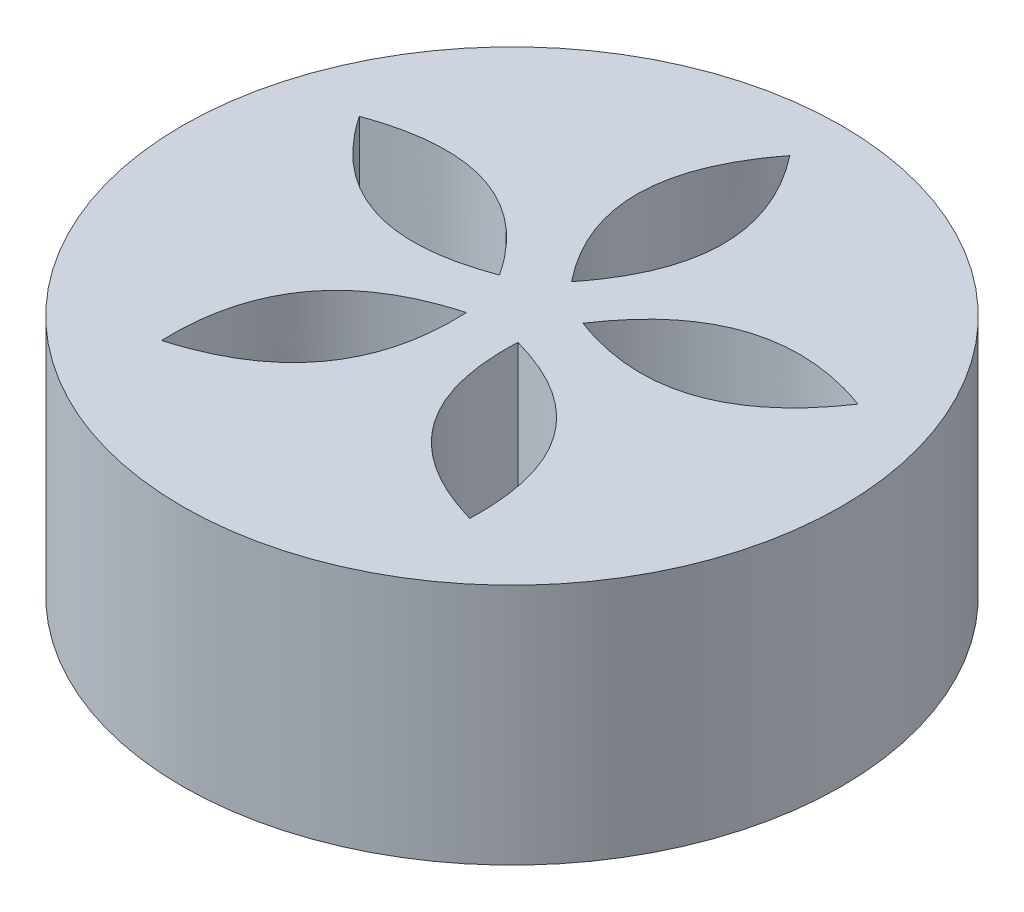
ISO-10303-21;
HEADER;
FILE_DESCRIPTION(('STEP AP214'),'2;1');
FILE_NAME('part.step','',(''),(''),'','','');
FILE_SCHEMA(('AUTOMOTIVE_DESIGN { 1 0 10303 214 1 1 1 1 }'));
ENDSEC;
DATA;
#1=APPLICATION_CONTEXT('core data for automotive mechanical design processes');
#2=APPLICATION_PROTOCOL_DEFINITION('international standard','automotive_design',2000,#1);
#3=PRODUCT_CONTEXT('',#1,'mechanical');
#4=PRODUCT('Part','Part','',(#3));
#5=PRODUCT_RELATED_PRODUCT_CATEGORY('part','',(#4));
#6=PRODUCT_DEFINITION_FORMATION('','',#4);
#7=PRODUCT_DEFINITION_CONTEXT('part definition',#1,'design');
#8=PRODUCT_DEFINITION('design','',#6,#7);
#9=PRODUCT_DEFINITION_SHAPE('','',#8);
#10=(LENGTH_UNIT() NAMED_UNIT(*) SI_UNIT(.MILLI.,.METRE.));
#11=(NAMED_UNIT(*) PLANE_ANGLE_UNIT() SI_UNIT($,.RADIAN.));
#12=(NAMED_UNIT(*) SI_UNIT($,.STERADIAN.) SOLID_ANGLE_UNIT());
#13=UNCERTAINTY_MEASURE_WITH_UNIT(LENGTH_MEASURE(1.E-05),#10,'distance_accuracy_value','');
#14=(GEOMETRIC_REPRESENTATION_CONTEXT(3) GLOBAL_UNCERTAINTY_ASSIGNED_CONTEXT((#13)) GLOBAL_UNIT_ASSIGNED_CONTEXT((#10,
#11,#12)) REPRESENTATION_CONTEXT('',''));
#15=CARTESIAN_POINT('',(0.,0.,0.));
#16=DIRECTION('',(0.,0.,1.));
#17=DIRECTION('',(1.,0.,0.));
#18=AXIS2_PLACEMENT_3D('',#15,#16,#17);
#19=CARTESIAN_POINT('',(0.,25.,0.));
#20=DIRECTION('',(0.,-1.,0.));
#21=DIRECTION('',(0.,0.,-1.));
#22=AXIS2_PLACEMENT_3D('',#19,#20,#21);
#23=CYLINDRICAL_SURFACE('',#22,34.);
#24=CARTESIAN_POINT('',(0.,25.,0.));
#25=DIRECTION('',(0.,1.,0.));
#26=DIRECTION('',(0.,0.,1.));
#27=AXIS2_PLACEMENT_3D('',#24,#25,#26);
#28=CIRCLE('',#27,34.);
#29=CARTESIAN_POINT('',(0.,25.,34.));
#30=VERTEX_POINT('',#29);
#31=EDGE_CURVE('E11',#30,#30,#28,.T.);
#32=ORIENTED_EDGE('',*,*,#31,.F.);
#33=EDGE_LOOP('',(#32));
#34=FACE_BOUND('',#33,.T.);
#35=CARTESIAN_POINT('',(0.,0.,0.));
#36=DIRECTION('',(0.,1.,0.));
#37=DIRECTION('',(0.,0.,1.));
#38=AXIS2_PLACEMENT_3D('',#35,#36,#37);
#39=CIRCLE('',#38,34.);
#40=CARTESIAN_POINT('',(0.,0.,34.));
#41=VERTEX_POINT('',#40);
#42=EDGE_CURVE('E39',#41,#41,#39,.T.);
#43=ORIENTED_EDGE('',*,*,#42,.T.);
#44=EDGE_LOOP('',(#43));
#45=FACE_BOUND('',#44,.T.);
#46=ADVANCED_FACE('F36',(#34,#45),#23,.T.);
#47=CARTESIAN_POINT('',(0.,25.,0.));
#48=DIRECTION('',(0.,1.,0.));
#49=DIRECTION('',(0.,0.,1.));
#50=AXIS2_PLACEMENT_3D('',#47,#48,#49);
#51=PLANE('',#50);
#52=CARTESIAN_POINT('',(25.7136760029647,25.,-9.97188350630448));
#53=CARTESIAN_POINT('',(17.6182519742214,25.,2.00829928825376));
#54=CARTESIAN_POINT('',(4.30416455451852,25.,-3.01551154998013));
#55=B_SPLINE_CURVE_WITH_KNOTS('',2,(#52,#53,#54),.UNSPECIFIED.,.F.,.F.,(3,3),(0.,1.),.UNSPECIFIED.);
#56=CARTESIAN_POINT('',(25.7136760029647,25.,-9.97188350630448));
#57=VERTEX_POINT('',#56);
#58=CARTESIAN_POINT('',(4.30416455451852,25.,-3.01551154998013));
#59=VERTEX_POINT('',#58);
#60=EDGE_CURVE('E50',#57,#59,#55,.T.);
#61=ORIENTED_EDGE('',*,*,#60,.T.);
#62=CARTESIAN_POINT('',(4.30416455451852,25.,-3.01551154998013));
#63=CARTESIAN_POINT('',(12.1225656206306,25.,-14.9056841276707));
#64=CARTESIAN_POINT('',(25.7136760029647,25.,-9.97188350630448));
#65=B_SPLINE_CURVE_WITH_KNOTS('',2,(#62,#63,#64),.UNSPECIFIED.,.F.,.F.,(3,3),(0.,1.),.UNSPECIFIED.);
#66=EDGE_CURVE('E217',#59,#57,#65,.T.);
#67=ORIENTED_EDGE('',*,*,#66,.T.);
#68=EDGE_LOOP('',(#61,#67));
#69=FACE_BOUND('',#68,.T.);
#70=CARTESIAN_POINT('',(15.891925745535,25.,20.2563555672349));
#71=CARTESIAN_POINT('',(1.99647123081033,25.,16.259229871763));
#72=CARTESIAN_POINT('',(2.66011998786504,25.,2.04433734719188));
#73=B_SPLINE_CURVE_WITH_KNOTS('',2,(#70,#71,#72),.UNSPECIFIED.,.F.,.F.,(3,3),(0.,1.),.UNSPECIFIED.);
#74=CARTESIAN_POINT('',(15.891925745535,25.,20.2563555672349));
#75=VERTEX_POINT('',#74);
#76=CARTESIAN_POINT('',(2.66011998786504,25.,2.04433734719188));
#77=VERTEX_POINT('',#76);
#78=EDGE_CURVE('E58',#75,#77,#73,.T.);
#79=ORIENTED_EDGE('',*,*,#78,.T.);
#80=CARTESIAN_POINT('',(2.66011998786504,25.,2.04433734719188));
#81=CARTESIAN_POINT('',(16.3843648960194,25.,5.80581323556946));
#82=CARTESIAN_POINT('',(15.891925745535,25.,20.2563555672349));
#83=B_SPLINE_CURVE_WITH_KNOTS('',2,(#80,#81,#82),.UNSPECIFIED.,.F.,.F.,(3,3),(0.,1.),.UNSPECIFIED.);
#84=EDGE_CURVE('E196',#77,#75,#83,.T.);
#85=ORIENTED_EDGE('',*,*,#84,.T.);
#86=EDGE_LOOP('',(#79,#85));
#87=FACE_BOUND('',#86,.T.);
#88=CARTESIAN_POINT('',(-15.8919257455347,25.,20.2563555672351));
#89=CARTESIAN_POINT('',(-16.3843648960193,25.,5.8058132355697));
#90=CARTESIAN_POINT('',(-2.66011998786498,25.,2.04433734719192));
#91=B_SPLINE_CURVE_WITH_KNOTS('',2,(#88,#89,#90),.UNSPECIFIED.,.F.,.F.,(3,3),(0.,1.),.UNSPECIFIED.);
#92=CARTESIAN_POINT('',(-15.8919257455347,25.,20.2563555672351));
#93=VERTEX_POINT('',#92);
#94=CARTESIAN_POINT('',(-2.66011998786498,25.,2.04433734719192));
#95=VERTEX_POINT('',#94);
#96=EDGE_CURVE('E165',#93,#95,#91,.T.);
#97=ORIENTED_EDGE('',*,*,#96,.T.);
#98=CARTESIAN_POINT('',(-2.66011998786498,25.,2.04433734719192));
#99=CARTESIAN_POINT('',(-1.99647123081007,25.,16.259229871763));
#100=CARTESIAN_POINT('',(-15.8919257455347,25.,20.2563555672351));
#101=B_SPLINE_CURVE_WITH_KNOTS('',2,(#98,#99,#100),.UNSPECIFIED.,.F.,.F.,(3,3),(0.,1.),.UNSPECIFIED.);
#102=EDGE_CURVE('E158',#95,#93,#101,.T.);
#103=ORIENTED_EDGE('',*,*,#102,.T.);
#104=EDGE_LOOP('',(#97,#103));
#105=FACE_BOUND('',#104,.T.);
#106=CARTESIAN_POINT('',(-25.7136760029649,25.,-9.97188350630411));
#107=CARTESIAN_POINT('',(-12.1225656206308,25.,-14.9056841276705));
#108=CARTESIAN_POINT('',(-4.30416455451854,25.,-3.01551154998007));
#109=B_SPLINE_CURVE_WITH_KNOTS('',2,(#106,#107,#108),.UNSPECIFIED.,.F.,.F.,(3,3),(0.,1.),.UNSPECIFIED.);
#110=CARTESIAN_POINT('',(-25.7136760029649,25.,-9.97188350630411));
#111=VERTEX_POINT('',#110);
#112=CARTESIAN_POINT('',(-4.30416455451854,25.,-3.01551154998007));
#113=VERTEX_POINT('',#112);
#114=EDGE_CURVE('E115',#111,#113,#109,.T.);
#115=ORIENTED_EDGE('',*,*,#114,.T.);
#116=CARTESIAN_POINT('',(-4.30416455451854,25.,-3.01551154998007));
#117=CARTESIAN_POINT('',(-17.6182519742214,25.,2.00829928825401));
#118=CARTESIAN_POINT('',(-25.7136760029649,25.,-9.97188350630411));
#119=B_SPLINE_CURVE_WITH_KNOTS('',2,(#116,#117,#118),.UNSPECIFIED.,.F.,.F.,(3,3),(0.,1.),.UNSPECIFIED.);
#120=EDGE_CURVE('E123',#113,#111,#119,.T.);
#121=ORIENTED_EDGE('',*,*,#120,.T.);
#122=EDGE_LOOP('',(#115,#121));
#123=FACE_BOUND('',#122,.T.);
#124=CARTESIAN_POINT('',(0.,25.,-6.14267014637105));
#125=CARTESIAN_POINT('',(-8.89220731161858,25.,-17.2526768198634));
#126=CARTESIAN_POINT('',(0.,25.,-28.653962673809));
#127=B_SPLINE_CURVE_WITH_KNOTS('',2,(#124,#125,#126),.UNSPECIFIED.,.F.,.F.,(3,3),(0.,1.),.UNSPECIFIED.);
#128=CARTESIAN_POINT('',(0.,25.,-6.14267014637105));
#129=VERTEX_POINT('',#128);
#130=CARTESIAN_POINT('',(0.,25.,-28.653962673809));
#131=VERTEX_POINT('',#130);
#132=EDGE_CURVE('E251',#129,#131,#127,.T.);
#133=ORIENTED_EDGE('',*,*,#132,.T.);
#134=CARTESIAN_POINT('',(0.,25.,-28.653962673809));
#135=CARTESIAN_POINT('',(8.89220731161858,25.,-17.2526768198634));
#136=CARTESIAN_POINT('',(0.,25.,-6.14267014637105));
#137=B_SPLINE_CURVE_WITH_KNOTS('',2,(#134,#135,#136),.UNSPECIFIED.,.F.,.F.,(3,3),(0.,1.),.UNSPECIFIED.);
#138=EDGE_CURVE('E257',#131,#129,#137,.T.);
#139=ORIENTED_EDGE('',*,*,#138,.T.);
#140=EDGE_LOOP('',(#133,#139));
#141=FACE_BOUND('',#140,.T.);
#142=ORIENTED_EDGE('',*,*,#31,.T.);
#143=EDGE_LOOP('',(#142));
#144=FACE_BOUND('',#143,.T.);
#145=ADVANCED_FACE('F129',(#69,#87,#105,#123,#141,#144),#51,.T.);
#146=CARTESIAN_POINT('',(0.,0.,0.));
#147=DIRECTION('',(0.,1.,0.));
#148=DIRECTION('',(0.,0.,1.));
#149=AXIS2_PLACEMENT_3D('',#146,#147,#148);
#150=PLANE('',#149);
#151=CARTESIAN_POINT('',(4.30416455451852,0.,-3.01551154998013));
#152=CARTESIAN_POINT('',(12.1225656206306,0.,-14.9056841276707));
#153=CARTESIAN_POINT('',(25.7136760029647,0.,-9.97188350630448));
#154=B_SPLINE_CURVE_WITH_KNOTS('',2,(#151,#152,#153),.UNSPECIFIED.,.F.,.F.,(3,3),(0.,1.),.UNSPECIFIED.);
#155=CARTESIAN_POINT('',(4.30416455451852,0.,-3.01551154998013));
#156=VERTEX_POINT('',#155);
#157=CARTESIAN_POINT('',(25.7136760029647,0.,-9.97188350630448));
#158=VERTEX_POINT('',#157);
#159=EDGE_CURVE('E235',#156,#158,#154,.T.);
#160=ORIENTED_EDGE('',*,*,#159,.F.);
#161=CARTESIAN_POINT('',(25.7136760029647,0.,-9.97188350630448));
#162=CARTESIAN_POINT('',(17.6182519742214,0.,2.00829928825376));
#163=CARTESIAN_POINT('',(4.30416455451852,0.,-3.01551154998013));
#164=B_SPLINE_CURVE_WITH_KNOTS('',2,(#161,#162,#163),.UNSPECIFIED.,.F.,.F.,(3,3),(0.,1.),.UNSPECIFIED.);
#165=EDGE_CURVE('E228',#158,#156,#164,.T.);
#166=ORIENTED_EDGE('',*,*,#165,.F.);
#167=EDGE_LOOP('',(#160,#166));
#168=FACE_BOUND('',#167,.T.);
#169=CARTESIAN_POINT('',(2.66011998786504,0.,2.04433734719188));
#170=CARTESIAN_POINT('',(16.3843648960194,0.,5.80581323556946));
#171=CARTESIAN_POINT('',(15.891925745535,0.,20.2563555672349));
#172=B_SPLINE_CURVE_WITH_KNOTS('',2,(#169,#170,#171),.UNSPECIFIED.,.F.,.F.,(3,3),(0.,1.),.UNSPECIFIED.);
#173=CARTESIAN_POINT('',(2.66011998786504,0.,2.04433734719188));
#174=VERTEX_POINT('',#173);
#175=CARTESIAN_POINT('',(15.891925745535,0.,20.2563555672349));
#176=VERTEX_POINT('',#175);
#177=EDGE_CURVE('E197',#174,#176,#172,.T.);
#178=ORIENTED_EDGE('',*,*,#177,.F.);
#179=CARTESIAN_POINT('',(15.891925745535,0.,20.2563555672349));
#180=CARTESIAN_POINT('',(1.99647123081033,0.,16.259229871763));
#181=CARTESIAN_POINT('',(2.66011998786504,0.,2.04433734719188));
#182=B_SPLINE_CURVE_WITH_KNOTS('',2,(#179,#180,#181),.UNSPECIFIED.,.F.,.F.,(3,3),(0.,1.),.UNSPECIFIED.);
#183=EDGE_CURVE('E248',#176,#174,#182,.T.);
#184=ORIENTED_EDGE('',*,*,#183,.F.);
#185=EDGE_LOOP('',(#178,#184));
#186=FACE_BOUND('',#185,.T.);
#187=CARTESIAN_POINT('',(-2.66011998786498,0.,2.04433734719192));
#188=CARTESIAN_POINT('',(-1.99647123081007,0.,16.259229871763));
#189=CARTESIAN_POINT('',(-15.8919257455347,0.,20.2563555672351));
#190=B_SPLINE_CURVE_WITH_KNOTS('',2,(#187,#188,#189),.UNSPECIFIED.,.F.,.F.,(3,3),(0.,1.),.UNSPECIFIED.);
#191=CARTESIAN_POINT('',(-2.66011998786498,0.,2.04433734719192));
#192=VERTEX_POINT('',#191);
#193=CARTESIAN_POINT('',(-15.8919257455347,0.,20.2563555672351));
#194=VERTEX_POINT('',#193);
#195=EDGE_CURVE('E176',#192,#194,#190,.T.);
#196=ORIENTED_EDGE('',*,*,#195,.F.);
#197=CARTESIAN_POINT('',(-15.8919257455347,0.,20.2563555672351));
#198=CARTESIAN_POINT('',(-16.3843648960193,0.,5.8058132355697));
#199=CARTESIAN_POINT('',(-2.66011998786498,0.,2.04433734719192));
#200=B_SPLINE_CURVE_WITH_KNOTS('',2,(#197,#198,#199),.UNSPECIFIED.,.F.,.F.,(3,3),(0.,1.),.UNSPECIFIED.);
#201=EDGE_CURVE('E169',#194,#192,#200,.T.);
#202=ORIENTED_EDGE('',*,*,#201,.F.);
#203=EDGE_LOOP('',(#196,#202));
#204=FACE_BOUND('',#203,.T.);
#205=CARTESIAN_POINT('',(-4.30416455451854,0.,-3.01551154998007));
#206=CARTESIAN_POINT('',(-17.6182519742214,0.,2.00829928825401));
#207=CARTESIAN_POINT('',(-25.7136760029649,0.,-9.97188350630411));
#208=B_SPLINE_CURVE_WITH_KNOTS('',2,(#205,#206,#207),.UNSPECIFIED.,.F.,.F.,(3,3),(0.,1.),.UNSPECIFIED.);
#209=CARTESIAN_POINT('',(-4.30416455451854,0.,-3.01551154998007));
#210=VERTEX_POINT('',#209);
#211=CARTESIAN_POINT('',(-25.7136760029649,0.,-9.97188350630411));
#212=VERTEX_POINT('',#211);
#213=EDGE_CURVE('E131',#210,#212,#208,.T.);
#214=ORIENTED_EDGE('',*,*,#213,.F.);
#215=CARTESIAN_POINT('',(-25.7136760029649,0.,-9.97188350630411));
#216=CARTESIAN_POINT('',(-12.1225656206308,0.,-14.9056841276705));
#217=CARTESIAN_POINT('',(-4.30416455451854,0.,-3.01551154998007));
#218=B_SPLINE_CURVE_WITH_KNOTS('',2,(#215,#216,#217),.UNSPECIFIED.,.F.,.F.,(3,3),(0.,1.),.UNSPECIFIED.);
#219=EDGE_CURVE('E118',#212,#210,#218,.T.);
#220=ORIENTED_EDGE('',*,*,#219,.F.);
#221=EDGE_LOOP('',(#214,#220));
#222=FACE_BOUND('',#221,.T.);
#223=CARTESIAN_POINT('',(0.,0.,-28.653962673809));
#224=CARTESIAN_POINT('',(8.89220731161858,0.,-17.2526768198634));
#225=CARTESIAN_POINT('',(0.,0.,-6.14267014637105));
#226=B_SPLINE_CURVE_WITH_KNOTS('',2,(#223,#224,#225),.UNSPECIFIED.,.F.,.F.,(3,3),(0.,1.),.UNSPECIFIED.);
#227=CARTESIAN_POINT('',(0.,0.,-28.653962673809));
#228=VERTEX_POINT('',#227);
#229=CARTESIAN_POINT('',(0.,0.,-6.14267014637105));
#230=VERTEX_POINT('',#229);
#231=EDGE_CURVE('E258',#228,#230,#226,.T.);
#232=ORIENTED_EDGE('',*,*,#231,.F.);
#233=CARTESIAN_POINT('',(0.,0.,-6.14267014637105));
#234=CARTESIAN_POINT('',(-8.89220731161858,0.,-17.2526768198634));
#235=CARTESIAN_POINT('',(0.,0.,-28.653962673809));
#236=B_SPLINE_CURVE_WITH_KNOTS('',2,(#233,#234,#235),.UNSPECIFIED.,.F.,.F.,(3,3),(0.,1.),.UNSPECIFIED.);
#237=EDGE_CURVE('E299',#230,#228,#236,.T.);
#238=ORIENTED_EDGE('',*,*,#237,.F.);
#239=EDGE_LOOP('',(#232,#238));
#240=FACE_BOUND('',#239,.T.);
#241=ORIENTED_EDGE('',*,*,#42,.F.);
#242=EDGE_LOOP('',(#241));
#243=FACE_BOUND('',#242,.T.);
#244=ADVANCED_FACE('F270',(#168,#186,#204,#222,#240,#243),#150,.F.);
#245=DIRECTION('',(0.,-1.,0.));
#246=VECTOR('',#245,1.);
#247=SURFACE_OF_LINEAR_EXTRUSION('',#127,#246);
#248=ORIENTED_EDGE('',*,*,#237,.T.);
#249=DIRECTION('',(0.,-1.,0.));
#250=VECTOR('',#249,1.);
#251=CARTESIAN_POINT('',(0.,25.,-28.653962673809));
#252=LINE('',#251,#250);
#253=EDGE_CURVE('E290',#131,#228,#252,.T.);
#254=ORIENTED_EDGE('',*,*,#253,.F.);
#255=ORIENTED_EDGE('',*,*,#132,.F.);
#256=DIRECTION('',(0.,-1.,0.));
#257=VECTOR('',#256,1.);
#258=CARTESIAN_POINT('',(0.,25.,-6.14267014637105));
#259=LINE('',#258,#257);
#260=EDGE_CURVE('E289',#129,#230,#259,.T.);
#261=ORIENTED_EDGE('',*,*,#260,.T.);
#262=EDGE_LOOP('',(#248,#254,#255,#261));
#263=FACE_BOUND('',#262,.T.);
#264=ADVANCED_FACE('F267',(#263),#247,.F.);
#265=DIRECTION('',(0.,-1.,0.));
#266=VECTOR('',#265,1.);
#267=SURFACE_OF_LINEAR_EXTRUSION('',#137,#266);
#268=ORIENTED_EDGE('',*,*,#231,.T.);
#269=ORIENTED_EDGE('',*,*,#260,.F.);
#270=ORIENTED_EDGE('',*,*,#138,.F.);
#271=ORIENTED_EDGE('',*,*,#253,.T.);
#272=EDGE_LOOP('',(#268,#269,#270,#271));
#273=FACE_BOUND('',#272,.T.);
#274=ADVANCED_FACE('F148',(#273),#267,.F.);
#275=DIRECTION('',(0.,-1.,0.));
#276=VECTOR('',#275,1.);
#277=SURFACE_OF_LINEAR_EXTRUSION('',#109,#276);
#278=ORIENTED_EDGE('',*,*,#219,.T.);
#279=DIRECTION('',(0.,-1.,0.));
#280=VECTOR('',#279,1.);
#281=CARTESIAN_POINT('',(-4.30416455451854,25.,-3.01551154998007));
#282=LINE('',#281,#280);
#283=EDGE_CURVE('E111',#113,#210,#282,.T.);
#284=ORIENTED_EDGE('',*,*,#283,.F.);
#285=ORIENTED_EDGE('',*,*,#114,.F.);
#286=DIRECTION('',(0.,-1.,0.));
#287=VECTOR('',#286,1.);
#288=CARTESIAN_POINT('',(-25.7136760029649,25.,-9.97188350630411));
#289=LINE('',#288,#287);
#290=EDGE_CURVE('E122',#111,#212,#289,.T.);
#291=ORIENTED_EDGE('',*,*,#290,.T.);
#292=EDGE_LOOP('',(#278,#284,#285,#291));
#293=FACE_BOUND('',#292,.T.);
#294=ADVANCED_FACE('F113',(#293),#277,.F.);
#295=DIRECTION('',(0.,-1.,0.));
#296=VECTOR('',#295,1.);
#297=SURFACE_OF_LINEAR_EXTRUSION('',#119,#296);
#298=ORIENTED_EDGE('',*,*,#213,.T.);
#299=ORIENTED_EDGE('',*,*,#290,.F.);
#300=ORIENTED_EDGE('',*,*,#120,.F.);
#301=ORIENTED_EDGE('',*,*,#283,.T.);
#302=EDGE_LOOP('',(#298,#299,#300,#301));
#303=FACE_BOUND('',#302,.T.);
#304=ADVANCED_FACE('F126',(#303),#297,.F.);
#305=DIRECTION('',(0.,-1.,0.));
#306=VECTOR('',#305,1.);
#307=SURFACE_OF_LINEAR_EXTRUSION('',#91,#306);
#308=ORIENTED_EDGE('',*,*,#201,.T.);
#309=DIRECTION('',(0.,-1.,0.));
#310=VECTOR('',#309,1.);
#311=CARTESIAN_POINT('',(-2.66011998786498,25.,2.04433734719192));
#312=LINE('',#311,#310);
#313=EDGE_CURVE('E164',#95,#192,#312,.T.);
#314=ORIENTED_EDGE('',*,*,#313,.F.);
#315=ORIENTED_EDGE('',*,*,#96,.F.);
#316=DIRECTION('',(0.,-1.,0.));
#317=VECTOR('',#316,1.);
#318=CARTESIAN_POINT('',(-15.8919257455347,25.,20.2563555672351));
#319=LINE('',#318,#317);
#320=EDGE_CURVE('E185',#93,#194,#319,.T.);
#321=ORIENTED_EDGE('',*,*,#320,.T.);
#322=EDGE_LOOP('',(#308,#314,#315,#321));
#323=FACE_BOUND('',#322,.T.);
#324=ADVANCED_FACE('F154',(#323),#307,.F.);
#325=DIRECTION('',(0.,-1.,0.));
#326=VECTOR('',#325,1.);
#327=SURFACE_OF_LINEAR_EXTRUSION('',#101,#326);
#328=ORIENTED_EDGE('',*,*,#195,.T.);
#329=ORIENTED_EDGE('',*,*,#320,.F.);
#330=ORIENTED_EDGE('',*,*,#102,.F.);
#331=ORIENTED_EDGE('',*,*,#313,.T.);
#332=EDGE_LOOP('',(#328,#329,#330,#331));
#333=FACE_BOUND('',#332,.T.);
#334=ADVANCED_FACE('F149',(#333),#327,.F.);
#335=DIRECTION('',(0.,-1.,0.));
#336=VECTOR('',#335,1.);
#337=SURFACE_OF_LINEAR_EXTRUSION('',#73,#336);
#338=ORIENTED_EDGE('',*,*,#183,.T.);
#339=DIRECTION('',(0.,-1.,0.));
#340=VECTOR('',#339,1.);
#341=CARTESIAN_POINT('',(2.66011998786504,25.,2.04433734719188));
#342=LINE('',#341,#340);
#343=EDGE_CURVE('E447',#77,#174,#342,.T.);
#344=ORIENTED_EDGE('',*,*,#343,.F.);
#345=ORIENTED_EDGE('',*,*,#78,.F.);
#346=DIRECTION('',(0.,-1.,0.));
#347=VECTOR('',#346,1.);
#348=CARTESIAN_POINT('',(15.891925745535,25.,20.2563555672349));
#349=LINE('',#348,#347);
#350=EDGE_CURVE('E177',#75,#176,#349,.T.);
#351=ORIENTED_EDGE('',*,*,#350,.T.);
#352=EDGE_LOOP('',(#338,#344,#345,#351));
#353=FACE_BOUND('',#352,.T.);
#354=ADVANCED_FACE('F153',(#353),#337,.F.);
#355=DIRECTION('',(0.,-1.,0.));
#356=VECTOR('',#355,1.);
#357=SURFACE_OF_LINEAR_EXTRUSION('',#83,#356);
#358=ORIENTED_EDGE('',*,*,#177,.T.);
#359=ORIENTED_EDGE('',*,*,#350,.F.);
#360=ORIENTED_EDGE('',*,*,#84,.F.);
#361=ORIENTED_EDGE('',*,*,#343,.T.);
#362=EDGE_LOOP('',(#358,#359,#360,#361));
#363=FACE_BOUND('',#362,.T.);
#364=ADVANCED_FACE('F208',(#363),#357,.F.);
#365=DIRECTION('',(0.,-1.,0.));
#366=VECTOR('',#365,1.);
#367=SURFACE_OF_LINEAR_EXTRUSION('',#55,#366);
#368=ORIENTED_EDGE('',*,*,#165,.T.);
#369=DIRECTION('',(0.,-1.,0.));
#370=VECTOR('',#369,1.);
#371=CARTESIAN_POINT('',(4.30416455451852,25.,-3.01551154998013));
#372=LINE('',#371,#370);
#373=EDGE_CURVE('E223',#59,#156,#372,.T.);
#374=ORIENTED_EDGE('',*,*,#373,.F.);
#375=ORIENTED_EDGE('',*,*,#60,.F.);
#376=DIRECTION('',(0.,-1.,0.));
#377=VECTOR('',#376,1.);
#378=CARTESIAN_POINT('',(25.7136760029647,25.,-9.97188350630448));
#379=LINE('',#378,#377);
#380=EDGE_CURVE('E243',#57,#158,#379,.T.);
#381=ORIENTED_EDGE('',*,*,#380,.T.);
#382=EDGE_LOOP('',(#368,#374,#375,#381));
#383=FACE_BOUND('',#382,.T.);
#384=ADVANCED_FACE('F213',(#383),#367,.F.);
#385=DIRECTION('',(0.,-1.,0.));
#386=VECTOR('',#385,1.);
#387=SURFACE_OF_LINEAR_EXTRUSION('',#65,#386);
#388=ORIENTED_EDGE('',*,*,#159,.T.);
#389=ORIENTED_EDGE('',*,*,#380,.F.);
#390=ORIENTED_EDGE('',*,*,#66,.F.);
#391=ORIENTED_EDGE('',*,*,#373,.T.);
#392=EDGE_LOOP('',(#388,#389,#390,#391));
#393=FACE_BOUND('',#392,.T.);
#394=ADVANCED_FACE('F209',(#393),#387,.F.);
#395=CLOSED_SHELL('',(#46,#145,#244,#264,#274,#294,#304,#324,#334,#354,#364,#384,#394));
#396=MANIFOLD_SOLID_BREP('B2',#395);
#397=ADVANCED_BREP_SHAPE_REPRESENTATION('',(#18,#396),#14);
#398=SHAPE_DEFINITION_REPRESENTATION(#9,#397);
ENDSEC;
END-ISO-10303-21;
